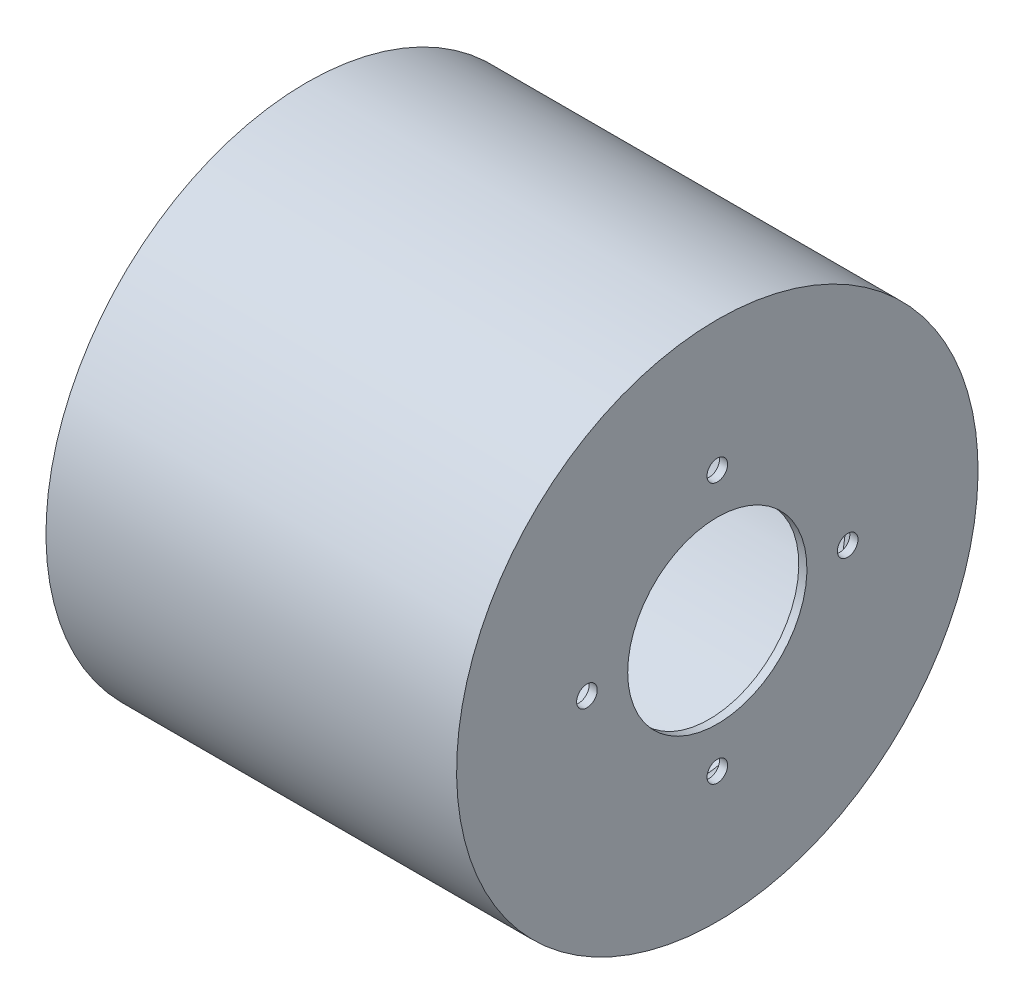
ISO-10303-21;
HEADER;
FILE_DESCRIPTION(('STEP AP214'),'2;1');
FILE_NAME('part.step','',(''),(''),'','','');
FILE_SCHEMA(('AUTOMOTIVE_DESIGN { 1 0 10303 214 1 1 1 1 }'));
ENDSEC;
DATA;
#1=APPLICATION_CONTEXT('core data for automotive mechanical design processes');
#2=APPLICATION_PROTOCOL_DEFINITION('international standard','automotive_design',2000,#1);
#3=PRODUCT_CONTEXT('',#1,'mechanical');
#4=PRODUCT('Part','Part','',(#3));
#5=PRODUCT_RELATED_PRODUCT_CATEGORY('part','',(#4));
#6=PRODUCT_DEFINITION_FORMATION('','',#4);
#7=PRODUCT_DEFINITION_CONTEXT('part definition',#1,'design');
#8=PRODUCT_DEFINITION('design','',#6,#7);
#9=PRODUCT_DEFINITION_SHAPE('','',#8);
#10=(LENGTH_UNIT() NAMED_UNIT(*) SI_UNIT(.MILLI.,.METRE.));
#11=(NAMED_UNIT(*) PLANE_ANGLE_UNIT() SI_UNIT($,.RADIAN.));
#12=(NAMED_UNIT(*) SI_UNIT($,.STERADIAN.) SOLID_ANGLE_UNIT());
#13=UNCERTAINTY_MEASURE_WITH_UNIT(LENGTH_MEASURE(1.E-05),#10,'distance_accuracy_value','');
#14=(GEOMETRIC_REPRESENTATION_CONTEXT(3) GLOBAL_UNCERTAINTY_ASSIGNED_CONTEXT((#13)) GLOBAL_UNIT_ASSIGNED_CONTEXT((#10,
#11,#12)) REPRESENTATION_CONTEXT('',''));
#15=CARTESIAN_POINT('',(0.,0.,0.));
#16=DIRECTION('',(0.,0.,1.));
#17=DIRECTION('',(1.,0.,0.));
#18=AXIS2_PLACEMENT_3D('',#15,#16,#17);
#19=CARTESIAN_POINT('',(76.835,0.,0.));
#20=DIRECTION('',(1.,0.,0.));
#21=DIRECTION('',(0.,1.,0.));
#22=AXIS2_PLACEMENT_3D('',#19,#20,#21);
#23=CYLINDRICAL_SURFACE('',#22,34.925);
#24=CARTESIAN_POINT('',(80.01,0.,0.));
#25=DIRECTION('',(-1.,0.,0.));
#26=DIRECTION('',(0.,0.,1.));
#27=AXIS2_PLACEMENT_3D('',#24,#25,#26);
#28=CIRCLE('',#27,34.925);
#29=CARTESIAN_POINT('',(80.01,0.,34.925));
#30=VERTEX_POINT('',#29);
#31=EDGE_CURVE('E8',#30,#30,#28,.T.);
#32=ORIENTED_EDGE('',*,*,#31,.F.);
#33=EDGE_LOOP('',(#32));
#34=FACE_BOUND('',#33,.T.);
#35=CARTESIAN_POINT('',(76.835,0.,0.));
#36=DIRECTION('',(1.,0.,0.));
#37=DIRECTION('',(0.,1.,0.));
#38=AXIS2_PLACEMENT_3D('',#35,#36,#37);
#39=CIRCLE('',#38,34.925);
#40=CARTESIAN_POINT('',(76.835,34.925,0.));
#41=VERTEX_POINT('',#40);
#42=EDGE_CURVE('E29',#41,#41,#39,.T.);
#43=ORIENTED_EDGE('',*,*,#42,.F.);
#44=EDGE_LOOP('',(#43));
#45=FACE_BOUND('',#44,.T.);
#46=ADVANCED_FACE('F13',(#34,#45),#23,.F.);
#47=CARTESIAN_POINT('',(76.835,0.,50.8));
#48=DIRECTION('',(1.,0.,0.));
#49=DIRECTION('',(0.,1.,0.));
#50=AXIS2_PLACEMENT_3D('',#47,#48,#49);
#51=CYLINDRICAL_SURFACE('',#50,4.0132);
#52=CARTESIAN_POINT('',(80.01,0.,50.8));
#53=DIRECTION('',(-1.,0.,0.));
#54=DIRECTION('',(0.,0.,1.));
#55=AXIS2_PLACEMENT_3D('',#52,#53,#54);
#56=CIRCLE('',#55,4.0132);
#57=CARTESIAN_POINT('',(80.01,0.,54.8132));
#58=VERTEX_POINT('',#57);
#59=EDGE_CURVE('E21',#58,#58,#56,.T.);
#60=ORIENTED_EDGE('',*,*,#59,.F.);
#61=EDGE_LOOP('',(#60));
#62=FACE_BOUND('',#61,.T.);
#63=CARTESIAN_POINT('',(76.835,0.,50.8));
#64=DIRECTION('',(1.,0.,0.));
#65=DIRECTION('',(0.,1.,0.));
#66=AXIS2_PLACEMENT_3D('',#63,#64,#65);
#67=CIRCLE('',#66,4.0132);
#68=CARTESIAN_POINT('',(76.835,4.01319999999999,50.8));
#69=VERTEX_POINT('',#68);
#70=EDGE_CURVE('E32',#69,#69,#67,.T.);
#71=ORIENTED_EDGE('',*,*,#70,.F.);
#72=EDGE_LOOP('',(#71));
#73=FACE_BOUND('',#72,.T.);
#74=ADVANCED_FACE('F92',(#62,#73),#51,.F.);
#75=CARTESIAN_POINT('',(76.835,-50.8,0.));
#76=DIRECTION('',(1.,0.,0.));
#77=DIRECTION('',(0.,1.,0.));
#78=AXIS2_PLACEMENT_3D('',#75,#76,#77);
#79=CYLINDRICAL_SURFACE('',#78,4.0132);
#80=CARTESIAN_POINT('',(80.01,-50.8,0.));
#81=DIRECTION('',(-1.,0.,0.));
#82=DIRECTION('',(0.,0.,1.));
#83=AXIS2_PLACEMENT_3D('',#80,#81,#82);
#84=CIRCLE('',#83,4.0132);
#85=CARTESIAN_POINT('',(80.01,-50.8,4.01319999999999));
#86=VERTEX_POINT('',#85);
#87=EDGE_CURVE('E26',#86,#86,#84,.T.);
#88=ORIENTED_EDGE('',*,*,#87,.F.);
#89=EDGE_LOOP('',(#88));
#90=FACE_BOUND('',#89,.T.);
#91=CARTESIAN_POINT('',(76.835,-50.8,0.));
#92=DIRECTION('',(1.,0.,0.));
#93=DIRECTION('',(0.,1.,0.));
#94=AXIS2_PLACEMENT_3D('',#91,#92,#93);
#95=CIRCLE('',#94,4.0132);
#96=CARTESIAN_POINT('',(76.835,-46.7868,0.));
#97=VERTEX_POINT('',#96);
#98=EDGE_CURVE('E36',#97,#97,#95,.T.);
#99=ORIENTED_EDGE('',*,*,#98,.F.);
#100=EDGE_LOOP('',(#99));
#101=FACE_BOUND('',#100,.T.);
#102=ADVANCED_FACE('F97',(#90,#101),#79,.F.);
#103=CARTESIAN_POINT('',(76.835,0.,-50.8));
#104=DIRECTION('',(1.,0.,0.));
#105=DIRECTION('',(0.,1.,0.));
#106=AXIS2_PLACEMENT_3D('',#103,#104,#105);
#107=CYLINDRICAL_SURFACE('',#106,4.0132);
#108=CARTESIAN_POINT('',(80.01,0.,-50.8));
#109=DIRECTION('',(-1.,0.,0.));
#110=DIRECTION('',(0.,0.,1.));
#111=AXIS2_PLACEMENT_3D('',#108,#109,#110);
#112=CIRCLE('',#111,4.0132);
#113=CARTESIAN_POINT('',(80.01,0.,-46.7868));
#114=VERTEX_POINT('',#113);
#115=EDGE_CURVE('E39',#114,#114,#112,.T.);
#116=ORIENTED_EDGE('',*,*,#115,.F.);
#117=EDGE_LOOP('',(#116));
#118=FACE_BOUND('',#117,.T.);
#119=CARTESIAN_POINT('',(76.835,0.,-50.8));
#120=DIRECTION('',(1.,0.,0.));
#121=DIRECTION('',(0.,1.,0.));
#122=AXIS2_PLACEMENT_3D('',#119,#120,#121);
#123=CIRCLE('',#122,4.0132);
#124=CARTESIAN_POINT('',(76.835,4.0132,-50.8));
#125=VERTEX_POINT('',#124);
#126=EDGE_CURVE('E42',#125,#125,#123,.T.);
#127=ORIENTED_EDGE('',*,*,#126,.F.);
#128=EDGE_LOOP('',(#127));
#129=FACE_BOUND('',#128,.T.);
#130=ADVANCED_FACE('F104',(#118,#129),#107,.F.);
#131=CARTESIAN_POINT('',(76.835,50.8,0.));
#132=DIRECTION('',(1.,0.,0.));
#133=DIRECTION('',(0.,1.,0.));
#134=AXIS2_PLACEMENT_3D('',#131,#132,#133);
#135=CYLINDRICAL_SURFACE('',#134,4.0132);
#136=CARTESIAN_POINT('',(80.01,50.8,0.));
#137=DIRECTION('',(-1.,0.,0.));
#138=DIRECTION('',(0.,0.,1.));
#139=AXIS2_PLACEMENT_3D('',#136,#137,#138);
#140=CIRCLE('',#139,4.0132);
#141=CARTESIAN_POINT('',(80.01,50.8,4.0132));
#142=VERTEX_POINT('',#141);
#143=EDGE_CURVE('E45',#142,#142,#140,.T.);
#144=ORIENTED_EDGE('',*,*,#143,.F.);
#145=EDGE_LOOP('',(#144));
#146=FACE_BOUND('',#145,.T.);
#147=CARTESIAN_POINT('',(76.835,50.8,0.));
#148=DIRECTION('',(1.,0.,0.));
#149=DIRECTION('',(0.,1.,0.));
#150=AXIS2_PLACEMENT_3D('',#147,#148,#149);
#151=CIRCLE('',#150,4.0132);
#152=CARTESIAN_POINT('',(76.835,54.8132,0.));
#153=VERTEX_POINT('',#152);
#154=EDGE_CURVE('E48',#153,#153,#151,.T.);
#155=ORIENTED_EDGE('',*,*,#154,.F.);
#156=EDGE_LOOP('',(#155));
#157=FACE_BOUND('',#156,.T.);
#158=ADVANCED_FACE('F108',(#146,#157),#135,.F.);
#159=CARTESIAN_POINT('',(80.01,50.8,0.));
#160=DIRECTION('',(1.,0.,0.));
#161=DIRECTION('',(0.,0.,-1.));
#162=AXIS2_PLACEMENT_3D('',#159,#160,#161);
#163=PLANE('',#162);
#164=ORIENTED_EDGE('',*,*,#31,.T.);
#165=EDGE_LOOP('',(#164));
#166=FACE_BOUND('',#165,.T.);
#167=ORIENTED_EDGE('',*,*,#59,.T.);
#168=EDGE_LOOP('',(#167));
#169=FACE_BOUND('',#168,.T.);
#170=ORIENTED_EDGE('',*,*,#87,.T.);
#171=EDGE_LOOP('',(#170));
#172=FACE_BOUND('',#171,.T.);
#173=ORIENTED_EDGE('',*,*,#115,.T.);
#174=EDGE_LOOP('',(#173));
#175=FACE_BOUND('',#174,.T.);
#176=ORIENTED_EDGE('',*,*,#143,.T.);
#177=EDGE_LOOP('',(#176));
#178=FACE_BOUND('',#177,.T.);
#179=CARTESIAN_POINT('',(80.01,0.,0.));
#180=DIRECTION('',(1.,0.,0.));
#181=DIRECTION('',(0.,1.,0.));
#182=AXIS2_PLACEMENT_3D('',#179,#180,#181);
#183=CIRCLE('',#182,101.6);
#184=CARTESIAN_POINT('',(80.01,101.6,0.));
#185=VERTEX_POINT('',#184);
#186=EDGE_CURVE('E31',#185,#185,#183,.T.);
#187=ORIENTED_EDGE('',*,*,#186,.T.);
#188=EDGE_LOOP('',(#187));
#189=FACE_BOUND('',#188,.T.);
#190=ADVANCED_FACE('F111',(#166,#169,#172,#175,#178,#189),#163,.T.);
#191=CARTESIAN_POINT('',(76.835,28.575,0.));
#192=DIRECTION('',(-1.,0.,0.));
#193=DIRECTION('',(0.,0.,1.));
#194=AXIS2_PLACEMENT_3D('',#191,#192,#193);
#195=PLANE('',#194);
#196=ORIENTED_EDGE('',*,*,#42,.T.);
#197=EDGE_LOOP('',(#196));
#198=FACE_BOUND('',#197,.T.);
#199=ORIENTED_EDGE('',*,*,#70,.T.);
#200=EDGE_LOOP('',(#199));
#201=FACE_BOUND('',#200,.T.);
#202=ORIENTED_EDGE('',*,*,#98,.T.);
#203=EDGE_LOOP('',(#202));
#204=FACE_BOUND('',#203,.T.);
#205=ORIENTED_EDGE('',*,*,#126,.T.);
#206=EDGE_LOOP('',(#205));
#207=FACE_BOUND('',#206,.T.);
#208=ORIENTED_EDGE('',*,*,#154,.T.);
#209=EDGE_LOOP('',(#208));
#210=FACE_BOUND('',#209,.T.);
#211=CARTESIAN_POINT('',(76.835,0.,0.));
#212=DIRECTION('',(1.,0.,0.));
#213=DIRECTION('',(0.,1.,0.));
#214=AXIS2_PLACEMENT_3D('',#211,#212,#213);
#215=CIRCLE('',#214,57.1500000000001);
#216=CARTESIAN_POINT('',(76.835,57.1500000000001,0.));
#217=VERTEX_POINT('',#216);
#218=EDGE_CURVE('E53',#217,#217,#215,.T.);
#219=ORIENTED_EDGE('',*,*,#218,.F.);
#220=EDGE_LOOP('',(#219));
#221=FACE_BOUND('',#220,.T.);
#222=ADVANCED_FACE('F136',(#198,#201,#204,#207,#210,#221),#195,.T.);
#223=CARTESIAN_POINT('',(76.835,0.,0.));
#224=DIRECTION('',(1.,0.,0.));
#225=DIRECTION('',(0.,1.,0.));
#226=AXIS2_PLACEMENT_3D('',#223,#224,#225);
#227=TOROIDAL_SURFACE('',#226,66.675,9.52499999999995);
#228=CARTESIAN_POINT('',(67.31,0.,0.));
#229=DIRECTION('',(1.,0.,0.));
#230=DIRECTION('',(0.,1.,0.));
#231=AXIS2_PLACEMENT_3D('',#228,#229,#230);
#232=CIRCLE('',#231,66.675);
#233=CARTESIAN_POINT('',(67.31,66.675,0.));
#234=VERTEX_POINT('',#233);
#235=EDGE_CURVE('E58',#234,#234,#232,.T.);
#236=ORIENTED_EDGE('',*,*,#235,.F.);
#237=EDGE_LOOP('',(#236));
#238=FACE_BOUND('',#237,.T.);
#239=ORIENTED_EDGE('',*,*,#218,.T.);
#240=EDGE_LOOP('',(#239));
#241=FACE_BOUND('',#240,.T.);
#242=ADVANCED_FACE('F130',(#238,#241),#227,.T.);
#243=CARTESIAN_POINT('',(67.31,73.025,0.));
#244=DIRECTION('',(-1.,0.,0.));
#245=DIRECTION('',(0.,0.,1.));
#246=AXIS2_PLACEMENT_3D('',#243,#244,#245);
#247=PLANE('',#246);
#248=CARTESIAN_POINT('',(67.31,0.,0.));
#249=DIRECTION('',(1.,0.,0.));
#250=DIRECTION('',(0.,1.,0.));
#251=AXIS2_PLACEMENT_3D('',#248,#249,#250);
#252=CIRCLE('',#251,79.375);
#253=CARTESIAN_POINT('',(67.31,79.375,0.));
#254=VERTEX_POINT('',#253);
#255=EDGE_CURVE('E61',#254,#254,#252,.T.);
#256=ORIENTED_EDGE('',*,*,#255,.F.);
#257=EDGE_LOOP('',(#256));
#258=FACE_BOUND('',#257,.T.);
#259=ORIENTED_EDGE('',*,*,#235,.T.);
#260=EDGE_LOOP('',(#259));
#261=FACE_BOUND('',#260,.T.);
#262=ADVANCED_FACE('F119',(#258,#261),#247,.T.);
#263=CARTESIAN_POINT('',(60.96,0.,0.));
#264=DIRECTION('',(1.,0.,0.));
#265=DIRECTION('',(0.,1.,0.));
#266=AXIS2_PLACEMENT_3D('',#263,#264,#265);
#267=TOROIDAL_SURFACE('',#266,79.375,6.34999999999998);
#268=CARTESIAN_POINT('',(60.96,0.,0.));
#269=DIRECTION('',(1.,0.,0.));
#270=DIRECTION('',(0.,1.,0.));
#271=AXIS2_PLACEMENT_3D('',#268,#269,#270);
#272=CIRCLE('',#271,85.725);
#273=CARTESIAN_POINT('',(60.96,85.725,0.));
#274=VERTEX_POINT('',#273);
#275=EDGE_CURVE('E64',#274,#274,#272,.T.);
#276=ORIENTED_EDGE('',*,*,#275,.F.);
#277=EDGE_LOOP('',(#276));
#278=FACE_BOUND('',#277,.T.);
#279=ORIENTED_EDGE('',*,*,#255,.T.);
#280=EDGE_LOOP('',(#279));
#281=FACE_BOUND('',#280,.T.);
#282=ADVANCED_FACE('F114',(#278,#281),#267,.F.);
#283=CARTESIAN_POINT('',(-1.58750000000001,0.,0.));
#284=DIRECTION('',(1.,0.,0.));
#285=DIRECTION('',(0.,1.,0.));
#286=AXIS2_PLACEMENT_3D('',#283,#284,#285);
#287=CYLINDRICAL_SURFACE('',#286,85.725);
#288=CARTESIAN_POINT('',(-64.135,0.,0.));
#289=DIRECTION('',(1.,0.,0.));
#290=DIRECTION('',(0.,1.,0.));
#291=AXIS2_PLACEMENT_3D('',#288,#289,#290);
#292=CIRCLE('',#291,85.725);
#293=CARTESIAN_POINT('',(-64.135,85.725,0.));
#294=VERTEX_POINT('',#293);
#295=EDGE_CURVE('E67',#294,#294,#292,.T.);
#296=ORIENTED_EDGE('',*,*,#295,.F.);
#297=EDGE_LOOP('',(#296));
#298=FACE_BOUND('',#297,.T.);
#299=ORIENTED_EDGE('',*,*,#275,.T.);
#300=EDGE_LOOP('',(#299));
#301=FACE_BOUND('',#300,.T.);
#302=ADVANCED_FACE('F87',(#298,#301),#287,.F.);
#303=CARTESIAN_POINT('',(-64.135,0.,0.));
#304=DIRECTION('',(1.,0.,0.));
#305=DIRECTION('',(0.,1.,0.));
#306=AXIS2_PLACEMENT_3D('',#303,#304,#305);
#307=TOROIDAL_SURFACE('',#306,98.425,12.7);
#308=CARTESIAN_POINT('',(-76.835,0.,0.));
#309=DIRECTION('',(1.,0.,0.));
#310=DIRECTION('',(0.,1.,0.));
#311=AXIS2_PLACEMENT_3D('',#308,#309,#310);
#312=CIRCLE('',#311,98.425);
#313=CARTESIAN_POINT('',(-76.835,98.425,0.));
#314=VERTEX_POINT('',#313);
#315=EDGE_CURVE('E69',#314,#314,#312,.T.);
#316=ORIENTED_EDGE('',*,*,#315,.F.);
#317=EDGE_LOOP('',(#316));
#318=FACE_BOUND('',#317,.T.);
#319=ORIENTED_EDGE('',*,*,#295,.T.);
#320=EDGE_LOOP('',(#319));
#321=FACE_BOUND('',#320,.T.);
#322=ADVANCED_FACE('F79',(#318,#321),#307,.T.);
#323=CARTESIAN_POINT('',(-76.835,0.,0.));
#324=DIRECTION('',(1.,0.,0.));
#325=DIRECTION('',(0.,1.,0.));
#326=AXIS2_PLACEMENT_3D('',#323,#324,#325);
#327=TOROIDAL_SURFACE('',#326,101.6,3.175);
#328=CARTESIAN_POINT('',(-80.01,0.,0.));
#329=DIRECTION('',(1.,0.,0.));
#330=DIRECTION('',(0.,1.,0.));
#331=AXIS2_PLACEMENT_3D('',#328,#329,#330);
#332=CIRCLE('',#331,101.6);
#333=CARTESIAN_POINT('',(-80.01,101.6,0.));
#334=VERTEX_POINT('',#333);
#335=EDGE_CURVE('E17',#334,#334,#332,.T.);
#336=ORIENTED_EDGE('',*,*,#335,.F.);
#337=EDGE_LOOP('',(#336));
#338=FACE_BOUND('',#337,.T.);
#339=ORIENTED_EDGE('',*,*,#315,.T.);
#340=EDGE_LOOP('',(#339));
#341=FACE_BOUND('',#340,.T.);
#342=ADVANCED_FACE('F77',(#338,#341),#327,.T.);
#343=CARTESIAN_POINT('',(0.,0.,0.));
#344=DIRECTION('',(1.,0.,0.));
#345=DIRECTION('',(0.,1.,0.));
#346=AXIS2_PLACEMENT_3D('',#343,#344,#345);
#347=CYLINDRICAL_SURFACE('',#346,101.6);
#348=ORIENTED_EDGE('',*,*,#186,.F.);
#349=EDGE_LOOP('',(#348));
#350=FACE_BOUND('',#349,.T.);
#351=ORIENTED_EDGE('',*,*,#335,.T.);
#352=EDGE_LOOP('',(#351));
#353=FACE_BOUND('',#352,.T.);
#354=ADVANCED_FACE('F15',(#350,#353),#347,.T.);
#355=CLOSED_SHELL('',(#46,#74,#102,#130,#158,#190,#222,#242,#262,#282,#302,#322,#342,#354));
#356=MANIFOLD_SOLID_BREP('B1',#355);
#357=ADVANCED_BREP_SHAPE_REPRESENTATION('',(#18,#356),#14);
#358=SHAPE_DEFINITION_REPRESENTATION(#9,#357);
ENDSEC;
END-ISO-10303-21;
